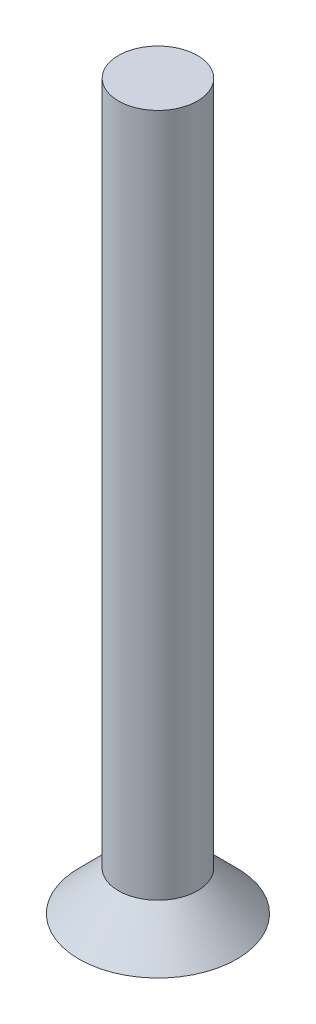
ISO-10303-21;
HEADER;
FILE_DESCRIPTION(('STEP AP214'),'2;1');
FILE_NAME('part.step','',(''),(''),'','','');
FILE_SCHEMA(('AUTOMOTIVE_DESIGN { 1 0 10303 214 1 1 1 1 }'));
ENDSEC;
DATA;
#1=APPLICATION_CONTEXT('core data for automotive mechanical design processes');
#2=APPLICATION_PROTOCOL_DEFINITION('international standard','automotive_design',2000,#1);
#3=PRODUCT_CONTEXT('',#1,'mechanical');
#4=PRODUCT('Part','Part','',(#3));
#5=PRODUCT_RELATED_PRODUCT_CATEGORY('part','',(#4));
#6=PRODUCT_DEFINITION_FORMATION('','',#4);
#7=PRODUCT_DEFINITION_CONTEXT('part definition',#1,'design');
#8=PRODUCT_DEFINITION('design','',#6,#7);
#9=PRODUCT_DEFINITION_SHAPE('','',#8);
#10=(LENGTH_UNIT() NAMED_UNIT(*) SI_UNIT(.MILLI.,.METRE.));
#11=(NAMED_UNIT(*) PLANE_ANGLE_UNIT() SI_UNIT($,.RADIAN.));
#12=(NAMED_UNIT(*) SI_UNIT($,.STERADIAN.) SOLID_ANGLE_UNIT());
#13=UNCERTAINTY_MEASURE_WITH_UNIT(LENGTH_MEASURE(1.E-05),#10,'distance_accuracy_value','');
#14=(GEOMETRIC_REPRESENTATION_CONTEXT(3) GLOBAL_UNCERTAINTY_ASSIGNED_CONTEXT((#13)) GLOBAL_UNIT_ASSIGNED_CONTEXT((#10,
#11,#12)) REPRESENTATION_CONTEXT('',''));
#15=CARTESIAN_POINT('',(0.,0.,0.));
#16=DIRECTION('',(0.,0.,1.));
#17=DIRECTION('',(1.,0.,0.));
#18=AXIS2_PLACEMENT_3D('',#15,#16,#17);
#19=CARTESIAN_POINT('',(0.,-15.,0.));
#20=DIRECTION('',(0.,-1.,0.));
#21=DIRECTION('',(0.,0.,-1.));
#22=AXIS2_PLACEMENT_3D('',#19,#20,#21);
#23=CONICAL_SURFACE('',#22,6.,0.785398163397454);
#24=CARTESIAN_POINT('',(0.,-12.,0.));
#25=DIRECTION('',(0.,1.,0.));
#26=DIRECTION('',(0.,0.,1.));
#27=AXIS2_PLACEMENT_3D('',#24,#25,#26);
#28=CIRCLE('',#27,3.);
#29=CARTESIAN_POINT('',(0.,-12.,3.));
#30=VERTEX_POINT('',#29);
#31=EDGE_CURVE('E10',#30,#30,#28,.T.);
#32=ORIENTED_EDGE('',*,*,#31,.F.);
#33=EDGE_LOOP('',(#32));
#34=FACE_BOUND('',#33,.T.);
#35=CARTESIAN_POINT('',(0.,-15.,0.));
#36=DIRECTION('',(0.,1.,0.));
#37=DIRECTION('',(0.,0.,1.));
#38=AXIS2_PLACEMENT_3D('',#35,#36,#37);
#39=CIRCLE('',#38,6.);
#40=CARTESIAN_POINT('',(0.,-15.,6.));
#41=VERTEX_POINT('',#40);
#42=EDGE_CURVE('E39',#41,#41,#39,.T.);
#43=ORIENTED_EDGE('',*,*,#42,.T.);
#44=EDGE_LOOP('',(#43));
#45=FACE_BOUND('',#44,.T.);
#46=ADVANCED_FACE('F29',(#34,#45),#23,.T.);
#47=CARTESIAN_POINT('',(0.,0.,0.));
#48=DIRECTION('',(0.,1.,0.));
#49=DIRECTION('',(0.,0.,1.));
#50=AXIS2_PLACEMENT_3D('',#47,#48,#49);
#51=CYLINDRICAL_SURFACE('',#50,3.);
#52=CARTESIAN_POINT('',(0.,40.,0.));
#53=DIRECTION('',(0.,1.,0.));
#54=DIRECTION('',(0.,0.,1.));
#55=AXIS2_PLACEMENT_3D('',#52,#53,#54);
#56=CIRCLE('',#55,3.);
#57=CARTESIAN_POINT('',(0.,40.,3.));
#58=VERTEX_POINT('',#57);
#59=EDGE_CURVE('E35',#58,#58,#56,.T.);
#60=ORIENTED_EDGE('',*,*,#59,.F.);
#61=EDGE_LOOP('',(#60));
#62=FACE_BOUND('',#61,.T.);
#63=ORIENTED_EDGE('',*,*,#31,.T.);
#64=EDGE_LOOP('',(#63));
#65=FACE_BOUND('',#64,.T.);
#66=ADVANCED_FACE('F54',(#62,#65),#51,.T.);
#67=CARTESIAN_POINT('',(0.,40.,0.));
#68=DIRECTION('',(0.,-1.,0.));
#69=DIRECTION('',(0.,0.,-1.));
#70=AXIS2_PLACEMENT_3D('',#67,#68,#69);
#71=PLANE('',#70);
#72=ORIENTED_EDGE('',*,*,#59,.T.);
#73=EDGE_LOOP('',(#72));
#74=FACE_BOUND('',#73,.T.);
#75=ADVANCED_FACE('F49',(#74),#71,.F.);
#76=CARTESIAN_POINT('',(6.,-15.,0.));
#77=DIRECTION('',(0.,1.,0.));
#78=DIRECTION('',(0.,0.,1.));
#79=AXIS2_PLACEMENT_3D('',#76,#77,#78);
#80=PLANE('',#79);
#81=ORIENTED_EDGE('',*,*,#42,.F.);
#82=EDGE_LOOP('',(#81));
#83=FACE_BOUND('',#82,.T.);
#84=ADVANCED_FACE('F47',(#83),#80,.F.);
#85=CLOSED_SHELL('',(#46,#66,#75,#84));
#86=MANIFOLD_SOLID_BREP('B2',#85);
#87=ADVANCED_BREP_SHAPE_REPRESENTATION('',(#18,#86),#14);
#88=SHAPE_DEFINITION_REPRESENTATION(#9,#87);
ENDSEC;
END-ISO-10303-21;
